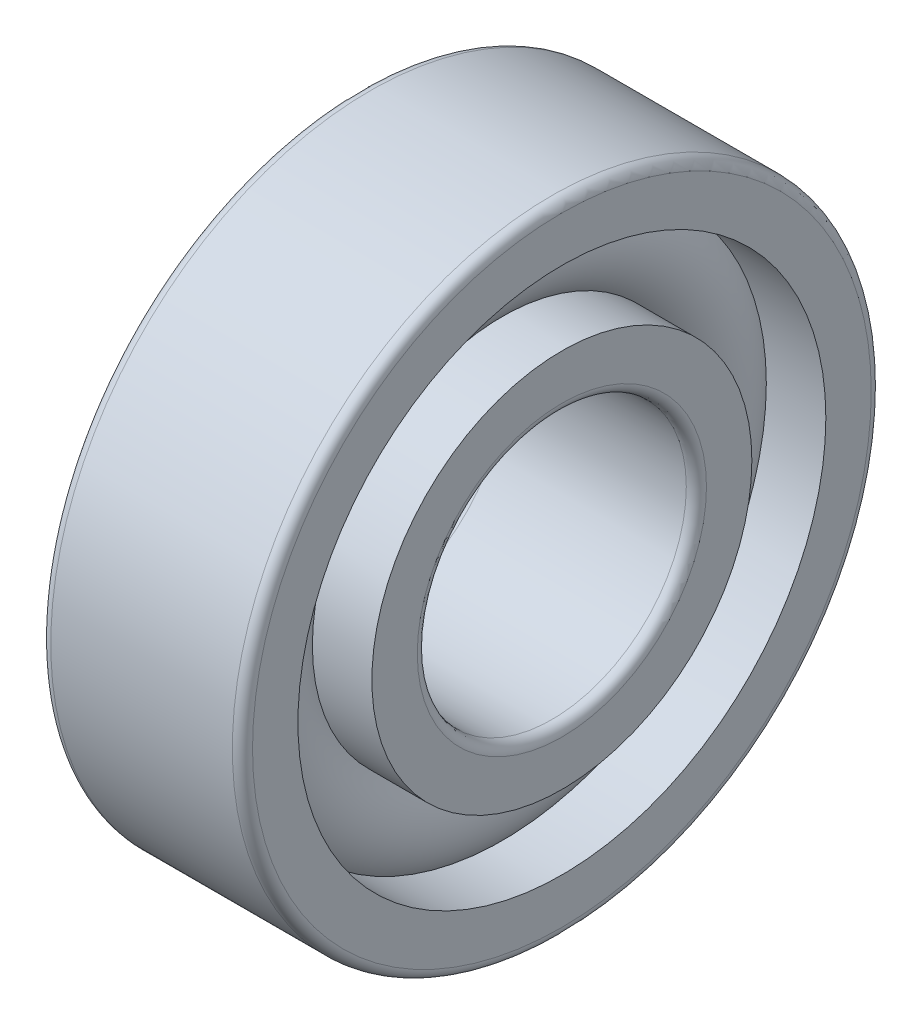
ISO-10303-21;
HEADER;
FILE_DESCRIPTION(('STEP AP214'),'2;1');
FILE_NAME('part.step','',(''),(''),'','','');
FILE_SCHEMA(('AUTOMOTIVE_DESIGN { 1 0 10303 214 1 1 1 1 }'));
ENDSEC;
DATA;
#1=APPLICATION_CONTEXT('core data for automotive mechanical design processes');
#2=APPLICATION_PROTOCOL_DEFINITION('international standard','automotive_design',2000,#1);
#3=PRODUCT_CONTEXT('',#1,'mechanical');
#4=PRODUCT('Part','Part','',(#3));
#5=PRODUCT_RELATED_PRODUCT_CATEGORY('part','',(#4));
#6=PRODUCT_DEFINITION_FORMATION('','',#4);
#7=PRODUCT_DEFINITION_CONTEXT('part definition',#1,'design');
#8=PRODUCT_DEFINITION('design','',#6,#7);
#9=PRODUCT_DEFINITION_SHAPE('','',#8);
#10=(LENGTH_UNIT() NAMED_UNIT(*) SI_UNIT(.MILLI.,.METRE.));
#11=(NAMED_UNIT(*) PLANE_ANGLE_UNIT() SI_UNIT($,.RADIAN.));
#12=(NAMED_UNIT(*) SI_UNIT($,.STERADIAN.) SOLID_ANGLE_UNIT());
#13=UNCERTAINTY_MEASURE_WITH_UNIT(LENGTH_MEASURE(1.E-05),#10,'distance_accuracy_value','');
#14=(GEOMETRIC_REPRESENTATION_CONTEXT(3) GLOBAL_UNCERTAINTY_ASSIGNED_CONTEXT((#13)) GLOBAL_UNIT_ASSIGNED_CONTEXT((#10,
#11,#12)) REPRESENTATION_CONTEXT('',''));
#15=CARTESIAN_POINT('',(0.,0.,0.));
#16=DIRECTION('',(0.,0.,1.));
#17=DIRECTION('',(1.,0.,0.));
#18=AXIS2_PLACEMENT_3D('',#15,#16,#17);
#19=CARTESIAN_POINT('',(0.,0.,0.));
#20=DIRECTION('',(-1.,0.,0.));
#21=DIRECTION('',(0.,0.,1.));
#22=AXIS2_PLACEMENT_3D('',#19,#20,#21);
#23=TOROIDAL_SURFACE('',#22,6.75,1.65);
#24=CARTESIAN_POINT('',(1.22983738762488,0.,0.));
#25=DIRECTION('',(-1.,0.,0.));
#26=DIRECTION('',(0.,0.,1.));
#27=AXIS2_PLACEMENT_3D('',#24,#25,#26);
#28=CIRCLE('',#27,7.85);
#29=CARTESIAN_POINT('',(1.22983738762488,0.,7.85));
#30=VERTEX_POINT('',#29);
#31=EDGE_CURVE('E18',#30,#30,#28,.F.);
#32=ORIENTED_EDGE('',*,*,#31,.T.);
#33=EDGE_LOOP('',(#32));
#34=FACE_BOUND('',#33,.T.);
#35=CARTESIAN_POINT('',(1.22983738762488,0.,0.));
#36=DIRECTION('',(-1.,0.,0.));
#37=DIRECTION('',(0.,0.,1.));
#38=AXIS2_PLACEMENT_3D('',#35,#36,#37);
#39=CIRCLE('',#38,5.65);
#40=CARTESIAN_POINT('',(1.22983738762488,0.,5.65));
#41=VERTEX_POINT('',#40);
#42=EDGE_CURVE('E10',#41,#41,#39,.T.);
#43=ORIENTED_EDGE('',*,*,#42,.T.);
#44=EDGE_LOOP('',(#43));
#45=FACE_BOUND('',#44,.T.);
#46=ADVANCED_FACE('F14',(#34,#45),#23,.T.);
#47=CARTESIAN_POINT('',(-20.6375,0.,0.));
#48=DIRECTION('',(1.,0.,0.));
#49=DIRECTION('',(0.,0.,-1.));
#50=AXIS2_PLACEMENT_3D('',#47,#48,#49);
#51=CYLINDRICAL_SURFACE('',#50,5.65);
#52=CARTESIAN_POINT('',(3.,0.,0.));
#53=DIRECTION('',(1.,0.,0.));
#54=DIRECTION('',(0.,0.,-1.));
#55=AXIS2_PLACEMENT_3D('',#52,#53,#54);
#56=CIRCLE('',#55,5.65);
#57=CARTESIAN_POINT('',(3.,0.,-5.65));
#58=VERTEX_POINT('',#57);
#59=EDGE_CURVE('E27',#58,#58,#56,.T.);
#60=ORIENTED_EDGE('',*,*,#59,.F.);
#61=EDGE_LOOP('',(#60));
#62=FACE_BOUND('',#61,.T.);
#63=ORIENTED_EDGE('',*,*,#42,.F.);
#64=EDGE_LOOP('',(#63));
#65=FACE_BOUND('',#64,.T.);
#66=ADVANCED_FACE('F66',(#62,#65),#51,.T.);
#67=CARTESIAN_POINT('',(-20.6375,0.,0.));
#68=DIRECTION('',(1.,0.,0.));
#69=DIRECTION('',(0.,0.,-1.));
#70=AXIS2_PLACEMENT_3D('',#67,#68,#69);
#71=CYLINDRICAL_SURFACE('',#70,5.65);
#72=CARTESIAN_POINT('',(-3.,0.,0.));
#73=DIRECTION('',(1.,0.,0.));
#74=DIRECTION('',(0.,0.,-1.));
#75=AXIS2_PLACEMENT_3D('',#72,#73,#74);
#76=CIRCLE('',#75,5.65);
#77=CARTESIAN_POINT('',(-3.,0.,-5.65));
#78=VERTEX_POINT('',#77);
#79=EDGE_CURVE('E36',#78,#78,#76,.T.);
#80=ORIENTED_EDGE('',*,*,#79,.T.);
#81=EDGE_LOOP('',(#80));
#82=FACE_BOUND('',#81,.T.);
#83=CARTESIAN_POINT('',(-1.22983738762488,0.,0.));
#84=DIRECTION('',(1.,0.,0.));
#85=DIRECTION('',(0.,0.,-1.));
#86=AXIS2_PLACEMENT_3D('',#83,#84,#85);
#87=CIRCLE('',#86,5.65);
#88=CARTESIAN_POINT('',(-1.22983738762488,0.,-5.65));
#89=VERTEX_POINT('',#88);
#90=EDGE_CURVE('E22',#89,#89,#87,.T.);
#91=ORIENTED_EDGE('',*,*,#90,.F.);
#92=EDGE_LOOP('',(#91));
#93=FACE_BOUND('',#92,.T.);
#94=ADVANCED_FACE('F69',(#82,#93),#71,.T.);
#95=CARTESIAN_POINT('',(3.,4.3,0.));
#96=DIRECTION('',(1.,0.,0.));
#97=DIRECTION('',(0.,0.,-1.));
#98=AXIS2_PLACEMENT_3D('',#95,#96,#97);
#99=PLANE('',#98);
#100=ORIENTED_EDGE('',*,*,#59,.T.);
#101=EDGE_LOOP('',(#100));
#102=FACE_BOUND('',#101,.T.);
#103=CARTESIAN_POINT('',(3.,0.,0.));
#104=DIRECTION('',(1.,0.,0.));
#105=DIRECTION('',(0.,0.,-1.));
#106=AXIS2_PLACEMENT_3D('',#103,#104,#105);
#107=CIRCLE('',#106,4.3);
#108=CARTESIAN_POINT('',(3.,0.,-4.3));
#109=VERTEX_POINT('',#108);
#110=EDGE_CURVE('E58',#109,#109,#107,.T.);
#111=ORIENTED_EDGE('',*,*,#110,.F.);
#112=EDGE_LOOP('',(#111));
#113=FACE_BOUND('',#112,.T.);
#114=ADVANCED_FACE('F63',(#102,#113),#99,.T.);
#115=CARTESIAN_POINT('',(2.7,0.,0.));
#116=DIRECTION('',(1.,0.,0.));
#117=DIRECTION('',(0.,0.,-1.));
#118=AXIS2_PLACEMENT_3D('',#115,#116,#117);
#119=TOROIDAL_SURFACE('',#118,4.3,0.3);
#120=ORIENTED_EDGE('',*,*,#110,.T.);
#121=EDGE_LOOP('',(#120));
#122=FACE_BOUND('',#121,.T.);
#123=CARTESIAN_POINT('',(2.7,0.,0.));
#124=DIRECTION('',(1.,0.,0.));
#125=DIRECTION('',(0.,0.,-1.));
#126=AXIS2_PLACEMENT_3D('',#123,#124,#125);
#127=CIRCLE('',#126,4.);
#128=CARTESIAN_POINT('',(2.7,0.,-4.));
#129=VERTEX_POINT('',#128);
#130=EDGE_CURVE('E55',#129,#129,#127,.T.);
#131=ORIENTED_EDGE('',*,*,#130,.F.);
#132=EDGE_LOOP('',(#131));
#133=FACE_BOUND('',#132,.T.);
#134=ADVANCED_FACE('F81',(#122,#133),#119,.T.);
#135=CARTESIAN_POINT('',(-20.6375,0.,0.));
#136=DIRECTION('',(1.,0.,0.));
#137=DIRECTION('',(0.,0.,-1.));
#138=AXIS2_PLACEMENT_3D('',#135,#136,#137);
#139=CYLINDRICAL_SURFACE('',#138,4.);
#140=ORIENTED_EDGE('',*,*,#130,.T.);
#141=EDGE_LOOP('',(#140));
#142=FACE_BOUND('',#141,.T.);
#143=CARTESIAN_POINT('',(-2.7,0.,0.));
#144=DIRECTION('',(1.,0.,0.));
#145=DIRECTION('',(0.,0.,-1.));
#146=AXIS2_PLACEMENT_3D('',#143,#144,#145);
#147=CIRCLE('',#146,4.);
#148=CARTESIAN_POINT('',(-2.7,0.,-4.));
#149=VERTEX_POINT('',#148);
#150=EDGE_CURVE('E52',#149,#149,#147,.T.);
#151=ORIENTED_EDGE('',*,*,#150,.F.);
#152=EDGE_LOOP('',(#151));
#153=FACE_BOUND('',#152,.T.);
#154=ADVANCED_FACE('F84',(#142,#153),#139,.F.);
#155=CARTESIAN_POINT('',(-2.7,0.,0.));
#156=DIRECTION('',(1.,0.,0.));
#157=DIRECTION('',(0.,0.,-1.));
#158=AXIS2_PLACEMENT_3D('',#155,#156,#157);
#159=TOROIDAL_SURFACE('',#158,4.3,0.3);
#160=ORIENTED_EDGE('',*,*,#150,.T.);
#161=EDGE_LOOP('',(#160));
#162=FACE_BOUND('',#161,.T.);
#163=CARTESIAN_POINT('',(-3.,0.,0.));
#164=DIRECTION('',(1.,0.,0.));
#165=DIRECTION('',(0.,0.,-1.));
#166=AXIS2_PLACEMENT_3D('',#163,#164,#165);
#167=CIRCLE('',#166,4.3);
#168=CARTESIAN_POINT('',(-3.,0.,-4.3));
#169=VERTEX_POINT('',#168);
#170=EDGE_CURVE('E49',#169,#169,#167,.T.);
#171=ORIENTED_EDGE('',*,*,#170,.F.);
#172=EDGE_LOOP('',(#171));
#173=FACE_BOUND('',#172,.T.);
#174=ADVANCED_FACE('F88',(#162,#173),#159,.T.);
#175=CARTESIAN_POINT('',(-3.,5.65,0.));
#176=DIRECTION('',(-1.,0.,0.));
#177=DIRECTION('',(0.,0.,1.));
#178=AXIS2_PLACEMENT_3D('',#175,#176,#177);
#179=PLANE('',#178);
#180=ORIENTED_EDGE('',*,*,#170,.T.);
#181=EDGE_LOOP('',(#180));
#182=FACE_BOUND('',#181,.T.);
#183=ORIENTED_EDGE('',*,*,#79,.F.);
#184=EDGE_LOOP('',(#183));
#185=FACE_BOUND('',#184,.T.);
#186=ADVANCED_FACE('F92',(#182,#185),#179,.T.);
#187=CARTESIAN_POINT('',(-1.22983738762488,0.,0.));
#188=DIRECTION('',(1.,0.,0.));
#189=DIRECTION('',(0.,0.,-1.));
#190=AXIS2_PLACEMENT_3D('',#187,#188,#189);
#191=CIRCLE('',#190,7.85);
#192=CARTESIAN_POINT('',(-1.22983738762488,0.,-7.85));
#193=VERTEX_POINT('',#192);
#194=EDGE_CURVE('E30',#193,#193,#191,.F.);
#195=ORIENTED_EDGE('',*,*,#194,.T.);
#196=EDGE_LOOP('',(#195));
#197=FACE_BOUND('',#196,.T.);
#198=ORIENTED_EDGE('',*,*,#90,.T.);
#199=EDGE_LOOP('',(#198));
#200=FACE_BOUND('',#199,.T.);
#201=ADVANCED_FACE('F16',(#197,#200),#23,.T.);
#202=CARTESIAN_POINT('',(-20.6375,0.,0.));
#203=DIRECTION('',(1.,0.,0.));
#204=DIRECTION('',(0.,0.,-1.));
#205=AXIS2_PLACEMENT_3D('',#202,#203,#204);
#206=CYLINDRICAL_SURFACE('',#205,7.85);
#207=CARTESIAN_POINT('',(3.,0.,0.));
#208=DIRECTION('',(1.,0.,0.));
#209=DIRECTION('',(0.,0.,-1.));
#210=AXIS2_PLACEMENT_3D('',#207,#208,#209);
#211=CIRCLE('',#210,7.85);
#212=CARTESIAN_POINT('',(3.,0.,-7.85));
#213=VERTEX_POINT('',#212);
#214=EDGE_CURVE('E32',#213,#213,#211,.T.);
#215=ORIENTED_EDGE('',*,*,#214,.T.);
#216=EDGE_LOOP('',(#215));
#217=FACE_BOUND('',#216,.T.);
#218=ORIENTED_EDGE('',*,*,#31,.F.);
#219=EDGE_LOOP('',(#218));
#220=FACE_BOUND('',#219,.T.);
#221=ADVANCED_FACE('F97',(#217,#220),#206,.F.);
#222=CARTESIAN_POINT('',(-20.6375,0.,0.));
#223=DIRECTION('',(1.,0.,0.));
#224=DIRECTION('',(0.,0.,-1.));
#225=AXIS2_PLACEMENT_3D('',#222,#223,#224);
#226=CYLINDRICAL_SURFACE('',#225,7.85);
#227=CARTESIAN_POINT('',(-3.,0.,0.));
#228=DIRECTION('',(1.,0.,0.));
#229=DIRECTION('',(0.,0.,-1.));
#230=AXIS2_PLACEMENT_3D('',#227,#228,#229);
#231=CIRCLE('',#230,7.85);
#232=CARTESIAN_POINT('',(-3.,0.,-7.85));
#233=VERTEX_POINT('',#232);
#234=EDGE_CURVE('E128',#233,#233,#231,.T.);
#235=ORIENTED_EDGE('',*,*,#234,.F.);
#236=EDGE_LOOP('',(#235));
#237=FACE_BOUND('',#236,.T.);
#238=ORIENTED_EDGE('',*,*,#194,.F.);
#239=EDGE_LOOP('',(#238));
#240=FACE_BOUND('',#239,.T.);
#241=ADVANCED_FACE('F100',(#237,#240),#226,.F.);
#242=CARTESIAN_POINT('',(3.,9.2,0.));
#243=DIRECTION('',(1.,0.,0.));
#244=DIRECTION('',(0.,0.,-1.));
#245=AXIS2_PLACEMENT_3D('',#242,#243,#244);
#246=PLANE('',#245);
#247=CARTESIAN_POINT('',(3.,0.,0.));
#248=DIRECTION('',(1.,0.,0.));
#249=DIRECTION('',(0.,0.,-1.));
#250=AXIS2_PLACEMENT_3D('',#247,#248,#249);
#251=CIRCLE('',#250,9.2);
#252=CARTESIAN_POINT('',(3.,0.,-9.2));
#253=VERTEX_POINT('',#252);
#254=EDGE_CURVE('E38',#253,#253,#251,.T.);
#255=ORIENTED_EDGE('',*,*,#254,.T.);
#256=EDGE_LOOP('',(#255));
#257=FACE_BOUND('',#256,.T.);
#258=ORIENTED_EDGE('',*,*,#214,.F.);
#259=EDGE_LOOP('',(#258));
#260=FACE_BOUND('',#259,.T.);
#261=ADVANCED_FACE('F101',(#257,#260),#246,.T.);
#262=CARTESIAN_POINT('',(2.7,0.,0.));
#263=DIRECTION('',(1.,0.,0.));
#264=DIRECTION('',(0.,0.,-1.));
#265=AXIS2_PLACEMENT_3D('',#262,#263,#264);
#266=TOROIDAL_SURFACE('',#265,9.2,0.299999999999999);
#267=CARTESIAN_POINT('',(2.7,0.,0.));
#268=DIRECTION('',(1.,0.,0.));
#269=DIRECTION('',(0.,0.,-1.));
#270=AXIS2_PLACEMENT_3D('',#267,#268,#269);
#271=CIRCLE('',#270,9.5);
#272=CARTESIAN_POINT('',(2.7,0.,-9.5));
#273=VERTEX_POINT('',#272);
#274=EDGE_CURVE('E43',#273,#273,#271,.T.);
#275=ORIENTED_EDGE('',*,*,#274,.T.);
#276=EDGE_LOOP('',(#275));
#277=FACE_BOUND('',#276,.T.);
#278=ORIENTED_EDGE('',*,*,#254,.F.);
#279=EDGE_LOOP('',(#278));
#280=FACE_BOUND('',#279,.T.);
#281=ADVANCED_FACE('F104',(#277,#280),#266,.T.);
#282=CARTESIAN_POINT('',(-20.6375,0.,0.));
#283=DIRECTION('',(1.,0.,0.));
#284=DIRECTION('',(0.,0.,-1.));
#285=AXIS2_PLACEMENT_3D('',#282,#283,#284);
#286=CYLINDRICAL_SURFACE('',#285,9.5);
#287=CARTESIAN_POINT('',(-2.7,0.,0.));
#288=DIRECTION('',(1.,0.,0.));
#289=DIRECTION('',(0.,0.,-1.));
#290=AXIS2_PLACEMENT_3D('',#287,#288,#289);
#291=CIRCLE('',#290,9.5);
#292=CARTESIAN_POINT('',(-2.7,0.,-9.5));
#293=VERTEX_POINT('',#292);
#294=EDGE_CURVE('E132',#293,#293,#291,.T.);
#295=ORIENTED_EDGE('',*,*,#294,.T.);
#296=EDGE_LOOP('',(#295));
#297=FACE_BOUND('',#296,.T.);
#298=ORIENTED_EDGE('',*,*,#274,.F.);
#299=EDGE_LOOP('',(#298));
#300=FACE_BOUND('',#299,.T.);
#301=ADVANCED_FACE('F108',(#297,#300),#286,.T.);
#302=CARTESIAN_POINT('',(-2.7,0.,0.));
#303=DIRECTION('',(1.,0.,0.));
#304=DIRECTION('',(0.,0.,-1.));
#305=AXIS2_PLACEMENT_3D('',#302,#303,#304);
#306=TOROIDAL_SURFACE('',#305,9.2,0.299999999999999);
#307=CARTESIAN_POINT('',(-3.,0.,0.));
#308=DIRECTION('',(1.,0.,0.));
#309=DIRECTION('',(0.,0.,-1.));
#310=AXIS2_PLACEMENT_3D('',#307,#308,#309);
#311=CIRCLE('',#310,9.2);
#312=CARTESIAN_POINT('',(-3.,0.,-9.2));
#313=VERTEX_POINT('',#312);
#314=EDGE_CURVE('E129',#313,#313,#311,.T.);
#315=ORIENTED_EDGE('',*,*,#314,.T.);
#316=EDGE_LOOP('',(#315));
#317=FACE_BOUND('',#316,.T.);
#318=ORIENTED_EDGE('',*,*,#294,.F.);
#319=EDGE_LOOP('',(#318));
#320=FACE_BOUND('',#319,.T.);
#321=ADVANCED_FACE('F112',(#317,#320),#306,.T.);
#322=CARTESIAN_POINT('',(-3.,7.85,0.));
#323=DIRECTION('',(-1.,0.,0.));
#324=DIRECTION('',(0.,0.,1.));
#325=AXIS2_PLACEMENT_3D('',#322,#323,#324);
#326=PLANE('',#325);
#327=ORIENTED_EDGE('',*,*,#234,.T.);
#328=EDGE_LOOP('',(#327));
#329=FACE_BOUND('',#328,.T.);
#330=ORIENTED_EDGE('',*,*,#314,.F.);
#331=EDGE_LOOP('',(#330));
#332=FACE_BOUND('',#331,.T.);
#333=ADVANCED_FACE('F116',(#329,#332),#326,.T.);
#334=CLOSED_SHELL('',(#46,#66,#94,#114,#134,#154,#174,#186,#201,#221,#241,#261,#281,#301,#321,#333));
#335=MANIFOLD_SOLID_BREP('B1',#334);
#336=ADVANCED_BREP_SHAPE_REPRESENTATION('',(#18,#335),#14);
#337=SHAPE_DEFINITION_REPRESENTATION(#9,#336);
ENDSEC;
END-ISO-10303-21;
